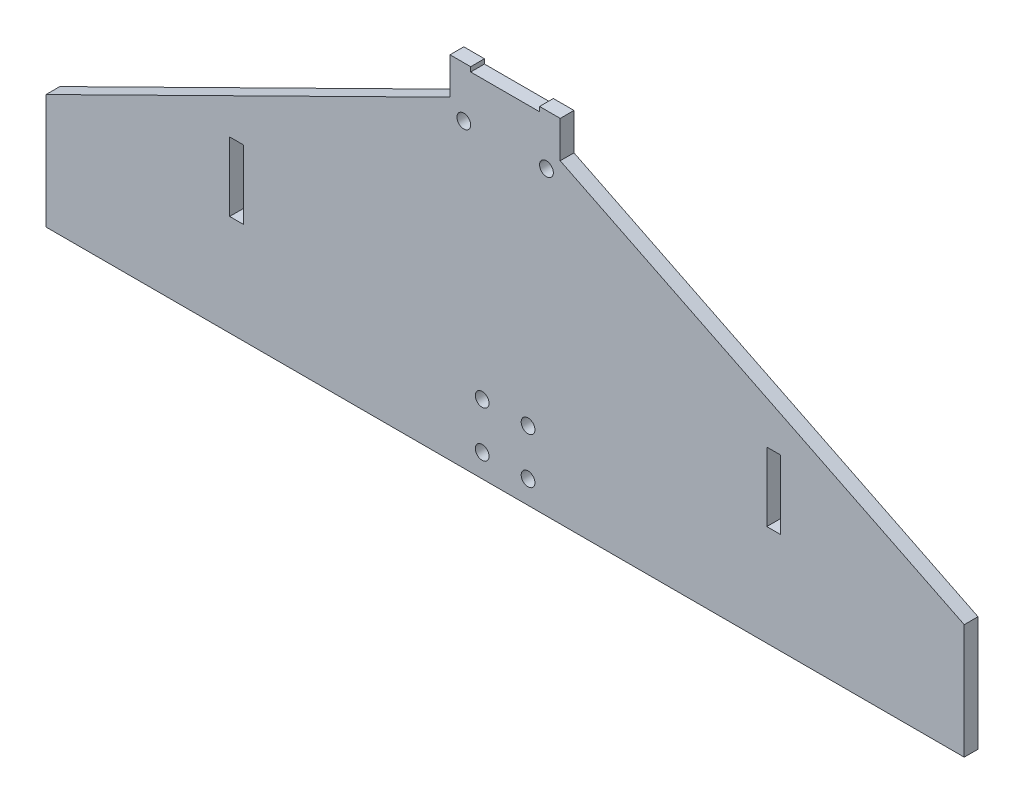
ISO-10303-21;
HEADER;
FILE_DESCRIPTION(('STEP AP214'),'2;1');
FILE_NAME('part.step','',(''),(''),'','','');
FILE_SCHEMA(('AUTOMOTIVE_DESIGN { 1 0 10303 214 1 1 1 1 }'));
ENDSEC;
DATA;
#1=APPLICATION_CONTEXT('core data for automotive mechanical design processes');
#2=APPLICATION_PROTOCOL_DEFINITION('international standard','automotive_design',2000,#1);
#3=PRODUCT_CONTEXT('',#1,'mechanical');
#4=PRODUCT('Part','Part','',(#3));
#5=PRODUCT_RELATED_PRODUCT_CATEGORY('part','',(#4));
#6=PRODUCT_DEFINITION_FORMATION('','',#4);
#7=PRODUCT_DEFINITION_CONTEXT('part definition',#1,'design');
#8=PRODUCT_DEFINITION('design','',#6,#7);
#9=PRODUCT_DEFINITION_SHAPE('','',#8);
#10=(LENGTH_UNIT() NAMED_UNIT(*) SI_UNIT(.MILLI.,.METRE.));
#11=(NAMED_UNIT(*) PLANE_ANGLE_UNIT() SI_UNIT($,.RADIAN.));
#12=(NAMED_UNIT(*) SI_UNIT($,.STERADIAN.) SOLID_ANGLE_UNIT());
#13=UNCERTAINTY_MEASURE_WITH_UNIT(LENGTH_MEASURE(1.E-05),#10,'distance_accuracy_value','');
#14=(GEOMETRIC_REPRESENTATION_CONTEXT(3) GLOBAL_UNCERTAINTY_ASSIGNED_CONTEXT((#13)) GLOBAL_UNIT_ASSIGNED_CONTEXT((#10,
#11,#12)) REPRESENTATION_CONTEXT('',''));
#15=CARTESIAN_POINT('',(0.,0.,0.));
#16=DIRECTION('',(0.,0.,1.));
#17=DIRECTION('',(1.,0.,0.));
#18=AXIS2_PLACEMENT_3D('',#15,#16,#17);
#19=CARTESIAN_POINT('',(-100.,5.00000000000003,3.));
#20=DIRECTION('',(1.,0.,0.));
#21=DIRECTION('',(0.,0.,-1.));
#22=AXIS2_PLACEMENT_3D('',#19,#20,#21);
#23=PLANE('',#22);
#24=DIRECTION('',(0.,-1.,0.));
#25=VECTOR('',#24,1.);
#26=CARTESIAN_POINT('',(-100.,5.00000000000003,0.));
#27=LINE('',#26,#25);
#28=CARTESIAN_POINT('',(-100.,5.00000000000003,0.));
#29=VERTEX_POINT('',#28);
#30=CARTESIAN_POINT('',(-100.,-20.,0.));
#31=VERTEX_POINT('',#30);
#32=EDGE_CURVE('E277',#29,#31,#27,.T.);
#33=ORIENTED_EDGE('',*,*,#32,.T.);
#34=DIRECTION('',(0.,0.,-1.));
#35=VECTOR('',#34,1.);
#36=CARTESIAN_POINT('',(-100.,-20.,3.));
#37=LINE('',#36,#35);
#38=CARTESIAN_POINT('',(-100.,-20.,3.));
#39=VERTEX_POINT('',#38);
#40=EDGE_CURVE('E334',#39,#31,#37,.T.);
#41=ORIENTED_EDGE('',*,*,#40,.F.);
#42=DIRECTION('',(0.,-1.,0.));
#43=VECTOR('',#42,1.);
#44=CARTESIAN_POINT('',(-100.,5.00000000000003,3.));
#45=LINE('',#44,#43);
#46=CARTESIAN_POINT('',(-100.,5.00000000000003,3.));
#47=VERTEX_POINT('',#46);
#48=EDGE_CURVE('E245',#47,#39,#45,.T.);
#49=ORIENTED_EDGE('',*,*,#48,.F.);
#50=DIRECTION('',(0.,0.,-1.));
#51=VECTOR('',#50,1.);
#52=CARTESIAN_POINT('',(-100.,5.00000000000003,3.));
#53=LINE('',#52,#51);
#54=EDGE_CURVE('E276',#47,#29,#53,.T.);
#55=ORIENTED_EDGE('',*,*,#54,.T.);
#56=EDGE_LOOP('',(#33,#41,#49,#55));
#57=FACE_BOUND('',#56,.T.);
#58=ADVANCED_FACE('F37',(#57),#23,.F.);
#59=CARTESIAN_POINT('',(-100.,-20.,3.));
#60=DIRECTION('',(0.,1.,0.));
#61=DIRECTION('',(0.,0.,1.));
#62=AXIS2_PLACEMENT_3D('',#59,#60,#61);
#63=PLANE('',#62);
#64=DIRECTION('',(1.,0.,0.));
#65=VECTOR('',#64,1.);
#66=CARTESIAN_POINT('',(-100.,-20.,0.));
#67=LINE('',#66,#65);
#68=CARTESIAN_POINT('',(100.,-20.,0.));
#69=VERTEX_POINT('',#68);
#70=EDGE_CURVE('E280',#31,#69,#67,.T.);
#71=ORIENTED_EDGE('',*,*,#70,.T.);
#72=DIRECTION('',(0.,0.,-1.));
#73=VECTOR('',#72,1.);
#74=CARTESIAN_POINT('',(100.,-20.,3.));
#75=LINE('',#74,#73);
#76=CARTESIAN_POINT('',(100.,-20.,3.));
#77=VERTEX_POINT('',#76);
#78=EDGE_CURVE('E332',#77,#69,#75,.T.);
#79=ORIENTED_EDGE('',*,*,#78,.F.);
#80=DIRECTION('',(1.,0.,0.));
#81=VECTOR('',#80,1.);
#82=CARTESIAN_POINT('',(-100.,-20.,3.));
#83=LINE('',#82,#81);
#84=EDGE_CURVE('E248',#39,#77,#83,.T.);
#85=ORIENTED_EDGE('',*,*,#84,.F.);
#86=ORIENTED_EDGE('',*,*,#40,.T.);
#87=EDGE_LOOP('',(#71,#79,#85,#86));
#88=FACE_BOUND('',#87,.T.);
#89=ADVANCED_FACE('F387',(#88),#63,.F.);
#90=CARTESIAN_POINT('',(100.,5.00000000000003,3.));
#91=DIRECTION('',(1.,0.,0.));
#92=DIRECTION('',(0.,0.,-1.));
#93=AXIS2_PLACEMENT_3D('',#90,#91,#92);
#94=PLANE('',#93);
#95=DIRECTION('',(0.,-1.,0.));
#96=VECTOR('',#95,1.);
#97=CARTESIAN_POINT('',(100.,5.00000000000003,0.));
#98=LINE('',#97,#96);
#99=CARTESIAN_POINT('',(100.,5.00000000000003,0.));
#100=VERTEX_POINT('',#99);
#101=EDGE_CURVE('E284',#100,#69,#98,.T.);
#102=ORIENTED_EDGE('',*,*,#101,.F.);
#103=DIRECTION('',(0.,0.,-1.));
#104=VECTOR('',#103,1.);
#105=CARTESIAN_POINT('',(100.,5.00000000000003,3.));
#106=LINE('',#105,#104);
#107=CARTESIAN_POINT('',(100.,5.00000000000003,3.));
#108=VERTEX_POINT('',#107);
#109=EDGE_CURVE('E330',#108,#100,#106,.T.);
#110=ORIENTED_EDGE('',*,*,#109,.F.);
#111=DIRECTION('',(0.,-1.,0.));
#112=VECTOR('',#111,1.);
#113=CARTESIAN_POINT('',(100.,5.00000000000003,3.));
#114=LINE('',#113,#112);
#115=EDGE_CURVE('E251',#108,#77,#114,.T.);
#116=ORIENTED_EDGE('',*,*,#115,.T.);
#117=ORIENTED_EDGE('',*,*,#78,.T.);
#118=EDGE_LOOP('',(#102,#110,#116,#117));
#119=FACE_BOUND('',#118,.T.);
#120=ADVANCED_FACE('F392',(#119),#94,.T.);
#121=CARTESIAN_POINT('',(12.,48.5,3.));
#122=DIRECTION('',(0.443134157673179,0.896455307476776,0.));
#123=DIRECTION('',(-0.896455307476777,0.443134157673179,0.));
#124=AXIS2_PLACEMENT_3D('',#121,#122,#123);
#125=PLANE('',#124);
#126=DIRECTION('',(0.896455307476776,-0.443134157673179,0.));
#127=VECTOR('',#126,1.);
#128=CARTESIAN_POINT('',(12.,48.5,0.));
#129=LINE('',#128,#127);
#130=CARTESIAN_POINT('',(12.,48.5,0.));
#131=VERTEX_POINT('',#130);
#132=EDGE_CURVE('E287',#131,#100,#129,.T.);
#133=ORIENTED_EDGE('',*,*,#132,.F.);
#134=DIRECTION('',(0.,0.,-1.));
#135=VECTOR('',#134,1.);
#136=CARTESIAN_POINT('',(12.,48.5,3.));
#137=LINE('',#136,#135);
#138=CARTESIAN_POINT('',(12.,48.5,3.));
#139=VERTEX_POINT('',#138);
#140=EDGE_CURVE('E328',#139,#131,#137,.T.);
#141=ORIENTED_EDGE('',*,*,#140,.F.);
#142=DIRECTION('',(0.896455307476776,-0.443134157673179,0.));
#143=VECTOR('',#142,1.);
#144=CARTESIAN_POINT('',(12.,48.5,3.));
#145=LINE('',#144,#143);
#146=EDGE_CURVE('E254',#139,#108,#145,.T.);
#147=ORIENTED_EDGE('',*,*,#146,.T.);
#148=ORIENTED_EDGE('',*,*,#109,.T.);
#149=EDGE_LOOP('',(#133,#141,#147,#148));
#150=FACE_BOUND('',#149,.T.);
#151=ADVANCED_FACE('F439',(#150),#125,.T.);
#152=CARTESIAN_POINT('',(12.,48.5,3.));
#153=DIRECTION('',(-1.,0.,0.));
#154=DIRECTION('',(0.,0.,1.));
#155=AXIS2_PLACEMENT_3D('',#152,#153,#154);
#156=PLANE('',#155);
#157=DIRECTION('',(0.,1.,0.));
#158=VECTOR('',#157,1.);
#159=CARTESIAN_POINT('',(12.,48.5,0.));
#160=LINE('',#159,#158);
#161=CARTESIAN_POINT('',(12.,56.4999999999999,0.));
#162=VERTEX_POINT('',#161);
#163=EDGE_CURVE('E290',#131,#162,#160,.T.);
#164=ORIENTED_EDGE('',*,*,#163,.T.);
#165=DIRECTION('',(0.,0.,-1.));
#166=VECTOR('',#165,1.);
#167=CARTESIAN_POINT('',(12.,56.4999999999999,3.));
#168=LINE('',#167,#166);
#169=CARTESIAN_POINT('',(12.,56.4999999999999,3.));
#170=VERTEX_POINT('',#169);
#171=EDGE_CURVE('E326',#170,#162,#168,.T.);
#172=ORIENTED_EDGE('',*,*,#171,.F.);
#173=DIRECTION('',(0.,1.,0.));
#174=VECTOR('',#173,1.);
#175=CARTESIAN_POINT('',(12.,48.5,3.));
#176=LINE('',#175,#174);
#177=EDGE_CURVE('E257',#139,#170,#176,.T.);
#178=ORIENTED_EDGE('',*,*,#177,.F.);
#179=ORIENTED_EDGE('',*,*,#140,.T.);
#180=EDGE_LOOP('',(#164,#172,#178,#179));
#181=FACE_BOUND('',#180,.T.);
#182=ADVANCED_FACE('F436',(#181),#156,.F.);
#183=CARTESIAN_POINT('',(7.50000000000051,56.4999999999999,3.));
#184=DIRECTION('',(0.,1.,0.));
#185=DIRECTION('',(-1.,0.,0.));
#186=AXIS2_PLACEMENT_3D('',#183,#184,#185);
#187=PLANE('',#186);
#188=DIRECTION('',(1.,0.,0.));
#189=VECTOR('',#188,1.);
#190=CARTESIAN_POINT('',(7.50000000000051,56.4999999999999,0.));
#191=LINE('',#190,#189);
#192=CARTESIAN_POINT('',(7.50000000000051,56.4999999999999,0.));
#193=VERTEX_POINT('',#192);
#194=EDGE_CURVE('E293',#193,#162,#191,.T.);
#195=ORIENTED_EDGE('',*,*,#194,.F.);
#196=DIRECTION('',(0.,0.,-1.));
#197=VECTOR('',#196,1.);
#198=CARTESIAN_POINT('',(7.50000000000051,56.4999999999999,3.));
#199=LINE('',#198,#197);
#200=CARTESIAN_POINT('',(7.50000000000051,56.4999999999999,3.));
#201=VERTEX_POINT('',#200);
#202=EDGE_CURVE('E324',#201,#193,#199,.T.);
#203=ORIENTED_EDGE('',*,*,#202,.F.);
#204=DIRECTION('',(1.,0.,0.));
#205=VECTOR('',#204,1.);
#206=CARTESIAN_POINT('',(7.50000000000051,56.4999999999999,3.));
#207=LINE('',#206,#205);
#208=EDGE_CURVE('E259',#201,#170,#207,.T.);
#209=ORIENTED_EDGE('',*,*,#208,.T.);
#210=ORIENTED_EDGE('',*,*,#171,.T.);
#211=EDGE_LOOP('',(#195,#203,#209,#210));
#212=FACE_BOUND('',#211,.T.);
#213=ADVANCED_FACE('F430',(#212),#187,.T.);
#214=CARTESIAN_POINT('',(7.50000000000051,56.4999999999999,3.));
#215=DIRECTION('',(1.,0.,0.));
#216=DIRECTION('',(0.,1.,0.));
#217=AXIS2_PLACEMENT_3D('',#214,#215,#216);
#218=PLANE('',#217);
#219=DIRECTION('',(0.,-1.,0.));
#220=VECTOR('',#219,1.);
#221=CARTESIAN_POINT('',(7.50000000000051,56.4999999999999,0.));
#222=LINE('',#221,#220);
#223=CARTESIAN_POINT('',(7.50000000000051,55.5,0.));
#224=VERTEX_POINT('',#223);
#225=EDGE_CURVE('E296',#193,#224,#222,.T.);
#226=ORIENTED_EDGE('',*,*,#225,.T.);
#227=DIRECTION('',(0.,0.,-1.));
#228=VECTOR('',#227,1.);
#229=CARTESIAN_POINT('',(7.50000000000051,55.5,3.));
#230=LINE('',#229,#228);
#231=CARTESIAN_POINT('',(7.50000000000051,55.5,3.));
#232=VERTEX_POINT('',#231);
#233=EDGE_CURVE('E321',#232,#224,#230,.T.);
#234=ORIENTED_EDGE('',*,*,#233,.F.);
#235=DIRECTION('',(0.,-1.,0.));
#236=VECTOR('',#235,1.);
#237=CARTESIAN_POINT('',(7.50000000000051,56.4999999999999,3.));
#238=LINE('',#237,#236);
#239=EDGE_CURVE('E262',#201,#232,#238,.T.);
#240=ORIENTED_EDGE('',*,*,#239,.F.);
#241=ORIENTED_EDGE('',*,*,#202,.T.);
#242=EDGE_LOOP('',(#226,#234,#240,#241));
#243=FACE_BOUND('',#242,.T.);
#244=ADVANCED_FACE('F442',(#243),#218,.F.);
#245=CARTESIAN_POINT('',(7.50000000000051,55.5,3.));
#246=DIRECTION('',(0.,-1.,0.));
#247=DIRECTION('',(1.,0.,0.));
#248=AXIS2_PLACEMENT_3D('',#245,#246,#247);
#249=PLANE('',#248);
#250=DIRECTION('',(-1.,0.,0.));
#251=VECTOR('',#250,1.);
#252=CARTESIAN_POINT('',(7.50000000000051,55.5,0.));
#253=LINE('',#252,#251);
#254=CARTESIAN_POINT('',(-7.50000000000049,55.5,0.));
#255=VERTEX_POINT('',#254);
#256=EDGE_CURVE('E298',#224,#255,#253,.T.);
#257=ORIENTED_EDGE('',*,*,#256,.T.);
#258=DIRECTION('',(0.,0.,-1.));
#259=VECTOR('',#258,1.);
#260=CARTESIAN_POINT('',(-7.50000000000049,55.5,3.));
#261=LINE('',#260,#259);
#262=CARTESIAN_POINT('',(-7.50000000000049,55.5,3.));
#263=VERTEX_POINT('',#262);
#264=EDGE_CURVE('E319',#263,#255,#261,.T.);
#265=ORIENTED_EDGE('',*,*,#264,.F.);
#266=DIRECTION('',(-1.,0.,0.));
#267=VECTOR('',#266,1.);
#268=CARTESIAN_POINT('',(7.50000000000051,55.5,3.));
#269=LINE('',#268,#267);
#270=EDGE_CURVE('E264',#232,#263,#269,.T.);
#271=ORIENTED_EDGE('',*,*,#270,.F.);
#272=ORIENTED_EDGE('',*,*,#233,.T.);
#273=EDGE_LOOP('',(#257,#265,#271,#272));
#274=FACE_BOUND('',#273,.T.);
#275=ADVANCED_FACE('F423',(#274),#249,.F.);
#276=CARTESIAN_POINT('',(-7.50000000000049,56.4999999999999,3.));
#277=DIRECTION('',(1.,0.,0.));
#278=DIRECTION('',(0.,0.,-1.));
#279=AXIS2_PLACEMENT_3D('',#276,#277,#278);
#280=PLANE('',#279);
#281=DIRECTION('',(0.,-1.,0.));
#282=VECTOR('',#281,1.);
#283=CARTESIAN_POINT('',(-7.50000000000049,56.4999999999999,0.));
#284=LINE('',#283,#282);
#285=CARTESIAN_POINT('',(-7.50000000000049,56.4999999999999,0.));
#286=VERTEX_POINT('',#285);
#287=EDGE_CURVE('E301',#286,#255,#284,.T.);
#288=ORIENTED_EDGE('',*,*,#287,.F.);
#289=DIRECTION('',(0.,0.,-1.));
#290=VECTOR('',#289,1.);
#291=CARTESIAN_POINT('',(-7.50000000000049,56.4999999999999,3.));
#292=LINE('',#291,#290);
#293=CARTESIAN_POINT('',(-7.50000000000049,56.4999999999999,3.));
#294=VERTEX_POINT('',#293);
#295=EDGE_CURVE('E317',#294,#286,#292,.T.);
#296=ORIENTED_EDGE('',*,*,#295,.F.);
#297=DIRECTION('',(0.,-1.,0.));
#298=VECTOR('',#297,1.);
#299=CARTESIAN_POINT('',(-7.50000000000049,56.4999999999999,3.));
#300=LINE('',#299,#298);
#301=EDGE_CURVE('E266',#294,#263,#300,.T.);
#302=ORIENTED_EDGE('',*,*,#301,.T.);
#303=ORIENTED_EDGE('',*,*,#264,.T.);
#304=EDGE_LOOP('',(#288,#296,#302,#303));
#305=FACE_BOUND('',#304,.T.);
#306=ADVANCED_FACE('F417',(#305),#280,.T.);
#307=CARTESIAN_POINT('',(-7.50000000000049,56.4999999999999,3.));
#308=DIRECTION('',(0.,-1.,0.));
#309=DIRECTION('',(0.,0.,-1.));
#310=AXIS2_PLACEMENT_3D('',#307,#308,#309);
#311=PLANE('',#310);
#312=DIRECTION('',(-1.,0.,0.));
#313=VECTOR('',#312,1.);
#314=CARTESIAN_POINT('',(-7.50000000000049,56.4999999999999,0.));
#315=LINE('',#314,#313);
#316=CARTESIAN_POINT('',(-12.,56.4999999999999,0.));
#317=VERTEX_POINT('',#316);
#318=EDGE_CURVE('E304',#286,#317,#315,.T.);
#319=ORIENTED_EDGE('',*,*,#318,.T.);
#320=DIRECTION('',(0.,0.,-1.));
#321=VECTOR('',#320,1.);
#322=CARTESIAN_POINT('',(-12.,56.4999999999999,3.));
#323=LINE('',#322,#321);
#324=CARTESIAN_POINT('',(-12.,56.4999999999999,3.));
#325=VERTEX_POINT('',#324);
#326=EDGE_CURVE('E315',#325,#317,#323,.T.);
#327=ORIENTED_EDGE('',*,*,#326,.F.);
#328=DIRECTION('',(-1.,0.,0.));
#329=VECTOR('',#328,1.);
#330=CARTESIAN_POINT('',(-7.50000000000049,56.4999999999999,3.));
#331=LINE('',#330,#329);
#332=EDGE_CURVE('E269',#294,#325,#331,.T.);
#333=ORIENTED_EDGE('',*,*,#332,.F.);
#334=ORIENTED_EDGE('',*,*,#295,.T.);
#335=EDGE_LOOP('',(#319,#327,#333,#334));
#336=FACE_BOUND('',#335,.T.);
#337=ADVANCED_FACE('F493',(#336),#311,.F.);
#338=CARTESIAN_POINT('',(-12.,48.5,3.));
#339=DIRECTION('',(-1.,0.,0.));
#340=DIRECTION('',(0.,0.,1.));
#341=AXIS2_PLACEMENT_3D('',#338,#339,#340);
#342=PLANE('',#341);
#343=DIRECTION('',(0.,1.,0.));
#344=VECTOR('',#343,1.);
#345=CARTESIAN_POINT('',(-12.,48.5,0.));
#346=LINE('',#345,#344);
#347=CARTESIAN_POINT('',(-12.,48.5,0.));
#348=VERTEX_POINT('',#347);
#349=EDGE_CURVE('E307',#348,#317,#346,.T.);
#350=ORIENTED_EDGE('',*,*,#349,.F.);
#351=DIRECTION('',(0.,0.,-1.));
#352=VECTOR('',#351,1.);
#353=CARTESIAN_POINT('',(-12.,48.5,3.));
#354=LINE('',#353,#352);
#355=CARTESIAN_POINT('',(-12.,48.5,3.));
#356=VERTEX_POINT('',#355);
#357=EDGE_CURVE('E313',#356,#348,#354,.T.);
#358=ORIENTED_EDGE('',*,*,#357,.F.);
#359=DIRECTION('',(0.,1.,0.));
#360=VECTOR('',#359,1.);
#361=CARTESIAN_POINT('',(-12.,48.5,3.));
#362=LINE('',#361,#360);
#363=EDGE_CURVE('E271',#356,#325,#362,.T.);
#364=ORIENTED_EDGE('',*,*,#363,.T.);
#365=ORIENTED_EDGE('',*,*,#326,.T.);
#366=EDGE_LOOP('',(#350,#358,#364,#365));
#367=FACE_BOUND('',#366,.T.);
#368=ADVANCED_FACE('F410',(#367),#342,.T.);
#369=CARTESIAN_POINT('',(-12.,48.5,3.));
#370=DIRECTION('',(0.443134157673179,-0.896455307476776,0.));
#371=DIRECTION('',(0.896455307476777,0.443134157673179,0.));
#372=AXIS2_PLACEMENT_3D('',#369,#370,#371);
#373=PLANE('',#372);
#374=DIRECTION('',(-0.896455307476777,-0.443134157673179,0.));
#375=VECTOR('',#374,1.);
#376=CARTESIAN_POINT('',(-12.,48.5,0.));
#377=LINE('',#376,#375);
#378=EDGE_CURVE('E249',#348,#29,#377,.T.);
#379=ORIENTED_EDGE('',*,*,#378,.T.);
#380=ORIENTED_EDGE('',*,*,#54,.F.);
#381=DIRECTION('',(-0.896455307476777,-0.443134157673179,0.));
#382=VECTOR('',#381,1.);
#383=CARTESIAN_POINT('',(-12.,48.5,3.));
#384=LINE('',#383,#382);
#385=EDGE_CURVE('E274',#356,#47,#384,.T.);
#386=ORIENTED_EDGE('',*,*,#385,.F.);
#387=ORIENTED_EDGE('',*,*,#357,.T.);
#388=EDGE_LOOP('',(#379,#380,#386,#387));
#389=FACE_BOUND('',#388,.T.);
#390=ADVANCED_FACE('F408',(#389),#373,.F.);
#391=CARTESIAN_POINT('',(0.,0.,3.));
#392=DIRECTION('',(0.,0.,1.));
#393=DIRECTION('',(1.,0.,0.));
#394=AXIS2_PLACEMENT_3D('',#391,#392,#393);
#395=PLANE('',#394);
#396=DIRECTION('',(0.,-1.,0.));
#397=VECTOR('',#396,1.);
#398=CARTESIAN_POINT('',(-60.,17.,3.));
#399=LINE('',#398,#397);
#400=CARTESIAN_POINT('',(-60.,17.,3.));
#401=VERTEX_POINT('',#400);
#402=CARTESIAN_POINT('',(-60.,2.00000000000003,3.));
#403=VERTEX_POINT('',#402);
#404=EDGE_CURVE('E51',#401,#403,#399,.T.);
#405=ORIENTED_EDGE('',*,*,#404,.F.);
#406=DIRECTION('',(-1.,0.,0.));
#407=VECTOR('',#406,1.);
#408=CARTESIAN_POINT('',(-60.,17.,3.));
#409=LINE('',#408,#407);
#410=CARTESIAN_POINT('',(-57.,17.,3.));
#411=VERTEX_POINT('',#410);
#412=EDGE_CURVE('E197',#411,#401,#409,.T.);
#413=ORIENTED_EDGE('',*,*,#412,.F.);
#414=DIRECTION('',(0.,1.,0.));
#415=VECTOR('',#414,1.);
#416=CARTESIAN_POINT('',(-57.,17.,3.));
#417=LINE('',#416,#415);
#418=CARTESIAN_POINT('',(-57.,2.00000000000003,3.));
#419=VERTEX_POINT('',#418);
#420=EDGE_CURVE('E180',#419,#411,#417,.T.);
#421=ORIENTED_EDGE('',*,*,#420,.F.);
#422=DIRECTION('',(1.,0.,0.));
#423=VECTOR('',#422,1.);
#424=CARTESIAN_POINT('',(-60.,2.00000000000003,3.));
#425=LINE('',#424,#423);
#426=EDGE_CURVE('E190',#403,#419,#425,.T.);
#427=ORIENTED_EDGE('',*,*,#426,.F.);
#428=EDGE_LOOP('',(#405,#413,#421,#427));
#429=FACE_BOUND('',#428,.T.);
#430=DIRECTION('',(-1.,0.,0.));
#431=VECTOR('',#430,1.);
#432=CARTESIAN_POINT('',(60.,17.,3.));
#433=LINE('',#432,#431);
#434=CARTESIAN_POINT('',(60.,17.,3.));
#435=VERTEX_POINT('',#434);
#436=CARTESIAN_POINT('',(57.,17.,3.));
#437=VERTEX_POINT('',#436);
#438=EDGE_CURVE('E59',#435,#437,#433,.T.);
#439=ORIENTED_EDGE('',*,*,#438,.F.);
#440=DIRECTION('',(0.,1.,0.));
#441=VECTOR('',#440,1.);
#442=CARTESIAN_POINT('',(60.,17.,3.));
#443=LINE('',#442,#441);
#444=CARTESIAN_POINT('',(60.,2.00000000000004,3.));
#445=VERTEX_POINT('',#444);
#446=EDGE_CURVE('E214',#445,#435,#443,.T.);
#447=ORIENTED_EDGE('',*,*,#446,.F.);
#448=DIRECTION('',(1.,0.,0.));
#449=VECTOR('',#448,1.);
#450=CARTESIAN_POINT('',(60.,2.00000000000004,3.));
#451=LINE('',#450,#449);
#452=CARTESIAN_POINT('',(57.,2.00000000000004,3.));
#453=VERTEX_POINT('',#452);
#454=EDGE_CURVE('E211',#453,#445,#451,.T.);
#455=ORIENTED_EDGE('',*,*,#454,.F.);
#456=DIRECTION('',(0.,-1.,0.));
#457=VECTOR('',#456,1.);
#458=CARTESIAN_POINT('',(57.,17.,3.));
#459=LINE('',#458,#457);
#460=EDGE_CURVE('E208',#437,#453,#459,.T.);
#461=ORIENTED_EDGE('',*,*,#460,.F.);
#462=EDGE_LOOP('',(#439,#447,#455,#461));
#463=FACE_BOUND('',#462,.T.);
#464=CARTESIAN_POINT('',(-9.,45.5,3.));
#465=DIRECTION('',(0.,0.,1.));
#466=DIRECTION('',(1.,0.,0.));
#467=AXIS2_PLACEMENT_3D('',#464,#465,#466);
#468=CIRCLE('',#467,1.5);
#469=CARTESIAN_POINT('',(-7.5,45.5,3.));
#470=VERTEX_POINT('',#469);
#471=EDGE_CURVE('E225',#470,#470,#468,.T.);
#472=ORIENTED_EDGE('',*,*,#471,.F.);
#473=EDGE_LOOP('',(#472));
#474=FACE_BOUND('',#473,.T.);
#475=CARTESIAN_POINT('',(9.,45.5,3.));
#476=DIRECTION('',(0.,0.,1.));
#477=DIRECTION('',(1.,0.,0.));
#478=AXIS2_PLACEMENT_3D('',#475,#476,#477);
#479=CIRCLE('',#478,1.5);
#480=CARTESIAN_POINT('',(10.5,45.5,3.));
#481=VERTEX_POINT('',#480);
#482=EDGE_CURVE('E204',#481,#481,#479,.T.);
#483=ORIENTED_EDGE('',*,*,#482,.F.);
#484=EDGE_LOOP('',(#483));
#485=FACE_BOUND('',#484,.T.);
#486=CARTESIAN_POINT('',(5.,-4.99999999999997,3.));
#487=DIRECTION('',(0.,0.,1.));
#488=DIRECTION('',(1.,0.,0.));
#489=AXIS2_PLACEMENT_3D('',#486,#487,#488);
#490=CIRCLE('',#489,1.5);
#491=CARTESIAN_POINT('',(6.5,-4.99999999999997,3.));
#492=VERTEX_POINT('',#491);
#493=EDGE_CURVE('E236',#492,#492,#490,.T.);
#494=ORIENTED_EDGE('',*,*,#493,.F.);
#495=EDGE_LOOP('',(#494));
#496=FACE_BOUND('',#495,.T.);
#497=CARTESIAN_POINT('',(-5.00000000000001,-15.,3.));
#498=DIRECTION('',(0.,0.,1.));
#499=DIRECTION('',(1.,0.,0.));
#500=AXIS2_PLACEMENT_3D('',#497,#498,#499);
#501=CIRCLE('',#500,1.5);
#502=CARTESIAN_POINT('',(-3.50000000000001,-15.,3.));
#503=VERTEX_POINT('',#502);
#504=EDGE_CURVE('E234',#503,#503,#501,.T.);
#505=ORIENTED_EDGE('',*,*,#504,.F.);
#506=EDGE_LOOP('',(#505));
#507=FACE_BOUND('',#506,.T.);
#508=CARTESIAN_POINT('',(5.,-15.,3.));
#509=DIRECTION('',(0.,0.,1.));
#510=DIRECTION('',(1.,0.,0.));
#511=AXIS2_PLACEMENT_3D('',#508,#509,#510);
#512=CIRCLE('',#511,1.5);
#513=CARTESIAN_POINT('',(6.5,-15.,3.));
#514=VERTEX_POINT('',#513);
#515=EDGE_CURVE('E231',#514,#514,#512,.T.);
#516=ORIENTED_EDGE('',*,*,#515,.F.);
#517=EDGE_LOOP('',(#516));
#518=FACE_BOUND('',#517,.T.);
#519=CARTESIAN_POINT('',(-5.,-4.99999999999997,3.));
#520=DIRECTION('',(0.,0.,1.));
#521=DIRECTION('',(1.,0.,0.));
#522=AXIS2_PLACEMENT_3D('',#519,#520,#521);
#523=CIRCLE('',#522,1.5);
#524=CARTESIAN_POINT('',(-3.5,-4.99999999999997,3.));
#525=VERTEX_POINT('',#524);
#526=EDGE_CURVE('E239',#525,#525,#523,.T.);
#527=ORIENTED_EDGE('',*,*,#526,.F.);
#528=EDGE_LOOP('',(#527));
#529=FACE_BOUND('',#528,.T.);
#530=ORIENTED_EDGE('',*,*,#48,.T.);
#531=ORIENTED_EDGE('',*,*,#84,.T.);
#532=ORIENTED_EDGE('',*,*,#115,.F.);
#533=ORIENTED_EDGE('',*,*,#146,.F.);
#534=ORIENTED_EDGE('',*,*,#177,.T.);
#535=ORIENTED_EDGE('',*,*,#208,.F.);
#536=ORIENTED_EDGE('',*,*,#239,.T.);
#537=ORIENTED_EDGE('',*,*,#270,.T.);
#538=ORIENTED_EDGE('',*,*,#301,.F.);
#539=ORIENTED_EDGE('',*,*,#332,.T.);
#540=ORIENTED_EDGE('',*,*,#363,.F.);
#541=ORIENTED_EDGE('',*,*,#385,.T.);
#542=EDGE_LOOP('',(#530,#531,#532,#533,#534,#535,#536,#537,#538,#539,#540,#541));
#543=FACE_BOUND('',#542,.T.);
#544=ADVANCED_FACE('F194',(#429,#463,#474,#485,#496,#507,#518,#529,#543),#395,.T.);
#545=CARTESIAN_POINT('',(0.,0.,0.));
#546=DIRECTION('',(0.,0.,1.));
#547=DIRECTION('',(1.,0.,0.));
#548=AXIS2_PLACEMENT_3D('',#545,#546,#547);
#549=PLANE('',#548);
#550=DIRECTION('',(-1.,0.,0.));
#551=VECTOR('',#550,1.);
#552=CARTESIAN_POINT('',(0.,17.,0.));
#553=LINE('',#552,#551);
#554=CARTESIAN_POINT('',(-57.,17.,0.));
#555=VERTEX_POINT('',#554);
#556=CARTESIAN_POINT('',(-60.,17.,0.));
#557=VERTEX_POINT('',#556);
#558=EDGE_CURVE('E44',#555,#557,#553,.T.);
#559=ORIENTED_EDGE('',*,*,#558,.T.);
#560=DIRECTION('',(0.,-1.,0.));
#561=VECTOR('',#560,1.);
#562=CARTESIAN_POINT('',(-60.,0.,0.));
#563=LINE('',#562,#561);
#564=CARTESIAN_POINT('',(-60.,2.00000000000003,0.));
#565=VERTEX_POINT('',#564);
#566=EDGE_CURVE('E11',#557,#565,#563,.T.);
#567=ORIENTED_EDGE('',*,*,#566,.T.);
#568=DIRECTION('',(1.,0.,0.));
#569=VECTOR('',#568,1.);
#570=CARTESIAN_POINT('',(0.,2.00000000000003,0.));
#571=LINE('',#570,#569);
#572=CARTESIAN_POINT('',(-57.,2.00000000000003,0.));
#573=VERTEX_POINT('',#572);
#574=EDGE_CURVE('E363',#565,#573,#571,.T.);
#575=ORIENTED_EDGE('',*,*,#574,.T.);
#576=DIRECTION('',(0.,1.,0.));
#577=VECTOR('',#576,1.);
#578=CARTESIAN_POINT('',(-57.,0.,0.));
#579=LINE('',#578,#577);
#580=EDGE_CURVE('E183',#573,#555,#579,.T.);
#581=ORIENTED_EDGE('',*,*,#580,.T.);
#582=EDGE_LOOP('',(#559,#567,#575,#581));
#583=FACE_BOUND('',#582,.T.);
#584=DIRECTION('',(0.,1.,0.));
#585=VECTOR('',#584,1.);
#586=CARTESIAN_POINT('',(60.,0.,0.));
#587=LINE('',#586,#585);
#588=CARTESIAN_POINT('',(60.,2.00000000000004,0.));
#589=VERTEX_POINT('',#588);
#590=CARTESIAN_POINT('',(60.,17.,0.));
#591=VERTEX_POINT('',#590);
#592=EDGE_CURVE('E357',#589,#591,#587,.T.);
#593=ORIENTED_EDGE('',*,*,#592,.T.);
#594=DIRECTION('',(-1.,0.,0.));
#595=VECTOR('',#594,1.);
#596=CARTESIAN_POINT('',(0.,17.,0.));
#597=LINE('',#596,#595);
#598=CARTESIAN_POINT('',(57.,17.,0.));
#599=VERTEX_POINT('',#598);
#600=EDGE_CURVE('E360',#591,#599,#597,.T.);
#601=ORIENTED_EDGE('',*,*,#600,.T.);
#602=DIRECTION('',(0.,-1.,0.));
#603=VECTOR('',#602,1.);
#604=CARTESIAN_POINT('',(57.,0.,0.));
#605=LINE('',#604,#603);
#606=CARTESIAN_POINT('',(57.,2.00000000000004,0.));
#607=VERTEX_POINT('',#606);
#608=EDGE_CURVE('E337',#599,#607,#605,.T.);
#609=ORIENTED_EDGE('',*,*,#608,.T.);
#610=DIRECTION('',(1.,0.,0.));
#611=VECTOR('',#610,1.);
#612=CARTESIAN_POINT('',(0.,2.00000000000002,0.));
#613=LINE('',#612,#611);
#614=EDGE_CURVE('E354',#607,#589,#613,.T.);
#615=ORIENTED_EDGE('',*,*,#614,.T.);
#616=EDGE_LOOP('',(#593,#601,#609,#615));
#617=FACE_BOUND('',#616,.T.);
#618=CARTESIAN_POINT('',(-9.,45.5,0.));
#619=DIRECTION('',(0.,0.,1.));
#620=DIRECTION('',(1.,0.,0.));
#621=AXIS2_PLACEMENT_3D('',#618,#619,#620);
#622=CIRCLE('',#621,1.5);
#623=CARTESIAN_POINT('',(-7.5,45.5,0.));
#624=VERTEX_POINT('',#623);
#625=EDGE_CURVE('E235',#624,#624,#622,.T.);
#626=ORIENTED_EDGE('',*,*,#625,.T.);
#627=EDGE_LOOP('',(#626));
#628=FACE_BOUND('',#627,.T.);
#629=CARTESIAN_POINT('',(9.,45.5,0.));
#630=DIRECTION('',(0.,0.,1.));
#631=DIRECTION('',(1.,0.,0.));
#632=AXIS2_PLACEMENT_3D('',#629,#630,#631);
#633=CIRCLE('',#632,1.5);
#634=CARTESIAN_POINT('',(10.5,45.5,0.));
#635=VERTEX_POINT('',#634);
#636=EDGE_CURVE('E228',#635,#635,#633,.T.);
#637=ORIENTED_EDGE('',*,*,#636,.T.);
#638=EDGE_LOOP('',(#637));
#639=FACE_BOUND('',#638,.T.);
#640=CARTESIAN_POINT('',(5.,-4.99999999999997,0.));
#641=DIRECTION('',(0.,0.,1.));
#642=DIRECTION('',(1.,0.,0.));
#643=AXIS2_PLACEMENT_3D('',#640,#641,#642);
#644=CIRCLE('',#643,1.5);
#645=CARTESIAN_POINT('',(6.5,-4.99999999999997,0.));
#646=VERTEX_POINT('',#645);
#647=EDGE_CURVE('E281',#646,#646,#644,.T.);
#648=ORIENTED_EDGE('',*,*,#647,.T.);
#649=EDGE_LOOP('',(#648));
#650=FACE_BOUND('',#649,.T.);
#651=CARTESIAN_POINT('',(-5.00000000000001,-15.,0.));
#652=DIRECTION('',(0.,0.,1.));
#653=DIRECTION('',(1.,0.,0.));
#654=AXIS2_PLACEMENT_3D('',#651,#652,#653);
#655=CIRCLE('',#654,1.5);
#656=CARTESIAN_POINT('',(-3.50000000000001,-15.,0.));
#657=VERTEX_POINT('',#656);
#658=EDGE_CURVE('E343',#657,#657,#655,.T.);
#659=ORIENTED_EDGE('',*,*,#658,.T.);
#660=EDGE_LOOP('',(#659));
#661=FACE_BOUND('',#660,.T.);
#662=CARTESIAN_POINT('',(5.,-15.,0.));
#663=DIRECTION('',(0.,0.,1.));
#664=DIRECTION('',(1.,0.,0.));
#665=AXIS2_PLACEMENT_3D('',#662,#663,#664);
#666=CIRCLE('',#665,1.5);
#667=CARTESIAN_POINT('',(6.5,-15.,0.));
#668=VERTEX_POINT('',#667);
#669=EDGE_CURVE('E340',#668,#668,#666,.T.);
#670=ORIENTED_EDGE('',*,*,#669,.T.);
#671=EDGE_LOOP('',(#670));
#672=FACE_BOUND('',#671,.T.);
#673=CARTESIAN_POINT('',(-5.,-4.99999999999997,0.));
#674=DIRECTION('',(0.,0.,1.));
#675=DIRECTION('',(1.,0.,0.));
#676=AXIS2_PLACEMENT_3D('',#673,#674,#675);
#677=CIRCLE('',#676,1.5);
#678=CARTESIAN_POINT('',(-3.5,-4.99999999999997,0.));
#679=VERTEX_POINT('',#678);
#680=EDGE_CURVE('E244',#679,#679,#677,.T.);
#681=ORIENTED_EDGE('',*,*,#680,.T.);
#682=EDGE_LOOP('',(#681));
#683=FACE_BOUND('',#682,.T.);
#684=ORIENTED_EDGE('',*,*,#32,.F.);
#685=ORIENTED_EDGE('',*,*,#378,.F.);
#686=ORIENTED_EDGE('',*,*,#349,.T.);
#687=ORIENTED_EDGE('',*,*,#318,.F.);
#688=ORIENTED_EDGE('',*,*,#287,.T.);
#689=ORIENTED_EDGE('',*,*,#256,.F.);
#690=ORIENTED_EDGE('',*,*,#225,.F.);
#691=ORIENTED_EDGE('',*,*,#194,.T.);
#692=ORIENTED_EDGE('',*,*,#163,.F.);
#693=ORIENTED_EDGE('',*,*,#132,.T.);
#694=ORIENTED_EDGE('',*,*,#101,.T.);
#695=ORIENTED_EDGE('',*,*,#70,.F.);
#696=EDGE_LOOP('',(#684,#685,#686,#687,#688,#689,#690,#691,#692,#693,#694,#695));
#697=FACE_BOUND('',#696,.T.);
#698=ADVANCED_FACE('F367',(#583,#617,#628,#639,#650,#661,#672,#683,#697),#549,.F.);
#699=CARTESIAN_POINT('',(-5.,-4.99999999999997,-2.));
#700=DIRECTION('',(0.,0.,1.));
#701=DIRECTION('',(1.,0.,0.));
#702=AXIS2_PLACEMENT_3D('',#699,#700,#701);
#703=CYLINDRICAL_SURFACE('',#702,1.5);
#704=ORIENTED_EDGE('',*,*,#526,.T.);
#705=EDGE_LOOP('',(#704));
#706=FACE_BOUND('',#705,.T.);
#707=ORIENTED_EDGE('',*,*,#680,.F.);
#708=EDGE_LOOP('',(#707));
#709=FACE_BOUND('',#708,.T.);
#710=ADVANCED_FACE('F523',(#706,#709),#703,.F.);
#711=CARTESIAN_POINT('',(5.,-15.,-2.));
#712=DIRECTION('',(0.,0.,1.));
#713=DIRECTION('',(1.,0.,0.));
#714=AXIS2_PLACEMENT_3D('',#711,#712,#713);
#715=CYLINDRICAL_SURFACE('',#714,1.5);
#716=ORIENTED_EDGE('',*,*,#515,.T.);
#717=EDGE_LOOP('',(#716));
#718=FACE_BOUND('',#717,.T.);
#719=ORIENTED_EDGE('',*,*,#669,.F.);
#720=EDGE_LOOP('',(#719));
#721=FACE_BOUND('',#720,.T.);
#722=ADVANCED_FACE('F528',(#718,#721),#715,.F.);
#723=CARTESIAN_POINT('',(-5.00000000000001,-15.,-2.));
#724=DIRECTION('',(0.,0.,1.));
#725=DIRECTION('',(1.,0.,0.));
#726=AXIS2_PLACEMENT_3D('',#723,#724,#725);
#727=CYLINDRICAL_SURFACE('',#726,1.5);
#728=ORIENTED_EDGE('',*,*,#504,.T.);
#729=EDGE_LOOP('',(#728));
#730=FACE_BOUND('',#729,.T.);
#731=ORIENTED_EDGE('',*,*,#658,.F.);
#732=EDGE_LOOP('',(#731));
#733=FACE_BOUND('',#732,.T.);
#734=ADVANCED_FACE('F540',(#730,#733),#727,.F.);
#735=CARTESIAN_POINT('',(5.,-4.99999999999997,-2.));
#736=DIRECTION('',(0.,0.,1.));
#737=DIRECTION('',(1.,0.,0.));
#738=AXIS2_PLACEMENT_3D('',#735,#736,#737);
#739=CYLINDRICAL_SURFACE('',#738,1.5);
#740=ORIENTED_EDGE('',*,*,#493,.T.);
#741=EDGE_LOOP('',(#740));
#742=FACE_BOUND('',#741,.T.);
#743=ORIENTED_EDGE('',*,*,#647,.F.);
#744=EDGE_LOOP('',(#743));
#745=FACE_BOUND('',#744,.T.);
#746=ADVANCED_FACE('F550',(#742,#745),#739,.F.);
#747=CARTESIAN_POINT('',(9.,45.5,-2.));
#748=DIRECTION('',(0.,0.,1.));
#749=DIRECTION('',(1.,0.,0.));
#750=AXIS2_PLACEMENT_3D('',#747,#748,#749);
#751=CYLINDRICAL_SURFACE('',#750,1.5);
#752=ORIENTED_EDGE('',*,*,#482,.T.);
#753=EDGE_LOOP('',(#752));
#754=FACE_BOUND('',#753,.T.);
#755=ORIENTED_EDGE('',*,*,#636,.F.);
#756=EDGE_LOOP('',(#755));
#757=FACE_BOUND('',#756,.T.);
#758=ADVANCED_FACE('F560',(#754,#757),#751,.F.);
#759=CARTESIAN_POINT('',(-9.,45.5,-2.));
#760=DIRECTION('',(0.,0.,1.));
#761=DIRECTION('',(1.,0.,0.));
#762=AXIS2_PLACEMENT_3D('',#759,#760,#761);
#763=CYLINDRICAL_SURFACE('',#762,1.5);
#764=ORIENTED_EDGE('',*,*,#471,.T.);
#765=EDGE_LOOP('',(#764));
#766=FACE_BOUND('',#765,.T.);
#767=ORIENTED_EDGE('',*,*,#625,.F.);
#768=EDGE_LOOP('',(#767));
#769=FACE_BOUND('',#768,.T.);
#770=ADVANCED_FACE('F570',(#766,#769),#763,.F.);
#771=CARTESIAN_POINT('',(60.,17.,-7.));
#772=DIRECTION('',(0.,1.,0.));
#773=DIRECTION('',(0.,0.,1.));
#774=AXIS2_PLACEMENT_3D('',#771,#772,#773);
#775=PLANE('',#774);
#776=DIRECTION('',(0.,0.,1.));
#777=VECTOR('',#776,1.);
#778=CARTESIAN_POINT('',(60.,17.,-7.));
#779=LINE('',#778,#777);
#780=EDGE_CURVE('E218',#591,#435,#779,.T.);
#781=ORIENTED_EDGE('',*,*,#780,.T.);
#782=ORIENTED_EDGE('',*,*,#438,.T.);
#783=DIRECTION('',(0.,0.,1.));
#784=VECTOR('',#783,1.);
#785=CARTESIAN_POINT('',(57.,17.,-7.));
#786=LINE('',#785,#784);
#787=EDGE_CURVE('E217',#599,#437,#786,.T.);
#788=ORIENTED_EDGE('',*,*,#787,.F.);
#789=ORIENTED_EDGE('',*,*,#600,.F.);
#790=EDGE_LOOP('',(#781,#782,#788,#789));
#791=FACE_BOUND('',#790,.T.);
#792=ADVANCED_FACE('F580',(#791),#775,.F.);
#793=CARTESIAN_POINT('',(60.,17.,-7.));
#794=DIRECTION('',(1.,0.,0.));
#795=DIRECTION('',(0.,0.,-1.));
#796=AXIS2_PLACEMENT_3D('',#793,#794,#795);
#797=PLANE('',#796);
#798=DIRECTION('',(0.,0.,1.));
#799=VECTOR('',#798,1.);
#800=CARTESIAN_POINT('',(60.,2.00000000000004,-7.));
#801=LINE('',#800,#799);
#802=EDGE_CURVE('E220',#589,#445,#801,.T.);
#803=ORIENTED_EDGE('',*,*,#802,.T.);
#804=ORIENTED_EDGE('',*,*,#446,.T.);
#805=ORIENTED_EDGE('',*,*,#780,.F.);
#806=ORIENTED_EDGE('',*,*,#592,.F.);
#807=EDGE_LOOP('',(#803,#804,#805,#806));
#808=FACE_BOUND('',#807,.T.);
#809=ADVANCED_FACE('F602',(#808),#797,.F.);
#810=CARTESIAN_POINT('',(60.,2.00000000000004,-7.));
#811=DIRECTION('',(0.,-1.,0.));
#812=DIRECTION('',(1.,0.,0.));
#813=AXIS2_PLACEMENT_3D('',#810,#811,#812);
#814=PLANE('',#813);
#815=DIRECTION('',(0.,0.,1.));
#816=VECTOR('',#815,1.);
#817=CARTESIAN_POINT('',(57.,2.00000000000004,-7.));
#818=LINE('',#817,#816);
#819=EDGE_CURVE('E222',#607,#453,#818,.T.);
#820=ORIENTED_EDGE('',*,*,#819,.T.);
#821=ORIENTED_EDGE('',*,*,#454,.T.);
#822=ORIENTED_EDGE('',*,*,#802,.F.);
#823=ORIENTED_EDGE('',*,*,#614,.F.);
#824=EDGE_LOOP('',(#820,#821,#822,#823));
#825=FACE_BOUND('',#824,.T.);
#826=ADVANCED_FACE('F381',(#825),#814,.F.);
#827=CARTESIAN_POINT('',(57.,17.,-7.));
#828=DIRECTION('',(-1.,0.,0.));
#829=DIRECTION('',(0.,0.,1.));
#830=AXIS2_PLACEMENT_3D('',#827,#828,#829);
#831=PLANE('',#830);
#832=ORIENTED_EDGE('',*,*,#787,.T.);
#833=ORIENTED_EDGE('',*,*,#460,.T.);
#834=ORIENTED_EDGE('',*,*,#819,.F.);
#835=ORIENTED_EDGE('',*,*,#608,.F.);
#836=EDGE_LOOP('',(#832,#833,#834,#835));
#837=FACE_BOUND('',#836,.T.);
#838=ADVANCED_FACE('F374',(#837),#831,.F.);
#839=CARTESIAN_POINT('',(-60.,17.,-7.));
#840=DIRECTION('',(-1.,0.,0.));
#841=DIRECTION('',(0.,0.,1.));
#842=AXIS2_PLACEMENT_3D('',#839,#840,#841);
#843=PLANE('',#842);
#844=DIRECTION('',(0.,0.,1.));
#845=VECTOR('',#844,1.);
#846=CARTESIAN_POINT('',(-60.,17.,-7.));
#847=LINE('',#846,#845);
#848=EDGE_CURVE('E202',#557,#401,#847,.T.);
#849=ORIENTED_EDGE('',*,*,#848,.T.);
#850=ORIENTED_EDGE('',*,*,#404,.T.);
#851=DIRECTION('',(0.,0.,1.));
#852=VECTOR('',#851,1.);
#853=CARTESIAN_POINT('',(-60.,2.00000000000003,-7.));
#854=LINE('',#853,#852);
#855=EDGE_CURVE('E187',#565,#403,#854,.T.);
#856=ORIENTED_EDGE('',*,*,#855,.F.);
#857=ORIENTED_EDGE('',*,*,#566,.F.);
#858=EDGE_LOOP('',(#849,#850,#856,#857));
#859=FACE_BOUND('',#858,.T.);
#860=ADVANCED_FACE('F372',(#859),#843,.F.);
#861=CARTESIAN_POINT('',(-60.,17.,-7.));
#862=DIRECTION('',(0.,1.,0.));
#863=DIRECTION('',(0.,0.,1.));
#864=AXIS2_PLACEMENT_3D('',#861,#862,#863);
#865=PLANE('',#864);
#866=DIRECTION('',(0.,0.,1.));
#867=VECTOR('',#866,1.);
#868=CARTESIAN_POINT('',(-57.,17.,-7.));
#869=LINE('',#868,#867);
#870=EDGE_CURVE('E186',#555,#411,#869,.T.);
#871=ORIENTED_EDGE('',*,*,#870,.T.);
#872=ORIENTED_EDGE('',*,*,#412,.T.);
#873=ORIENTED_EDGE('',*,*,#848,.F.);
#874=ORIENTED_EDGE('',*,*,#558,.F.);
#875=EDGE_LOOP('',(#871,#872,#873,#874));
#876=FACE_BOUND('',#875,.T.);
#877=ADVANCED_FACE('F371',(#876),#865,.F.);
#878=CARTESIAN_POINT('',(-57.,17.,-7.));
#879=DIRECTION('',(1.,0.,0.));
#880=DIRECTION('',(0.,1.,0.));
#881=AXIS2_PLACEMENT_3D('',#878,#879,#880);
#882=PLANE('',#881);
#883=DIRECTION('',(0.,0.,1.));
#884=VECTOR('',#883,1.);
#885=CARTESIAN_POINT('',(-57.,2.00000000000003,-7.));
#886=LINE('',#885,#884);
#887=EDGE_CURVE('E175',#573,#419,#886,.T.);
#888=ORIENTED_EDGE('',*,*,#887,.T.);
#889=ORIENTED_EDGE('',*,*,#420,.T.);
#890=ORIENTED_EDGE('',*,*,#870,.F.);
#891=ORIENTED_EDGE('',*,*,#580,.F.);
#892=EDGE_LOOP('',(#888,#889,#890,#891));
#893=FACE_BOUND('',#892,.T.);
#894=ADVANCED_FACE('F177',(#893),#882,.F.);
#895=CARTESIAN_POINT('',(-60.,2.00000000000003,-7.));
#896=DIRECTION('',(0.,-1.,0.));
#897=DIRECTION('',(0.,0.,-1.));
#898=AXIS2_PLACEMENT_3D('',#895,#896,#897);
#899=PLANE('',#898);
#900=ORIENTED_EDGE('',*,*,#855,.T.);
#901=ORIENTED_EDGE('',*,*,#426,.T.);
#902=ORIENTED_EDGE('',*,*,#887,.F.);
#903=ORIENTED_EDGE('',*,*,#574,.F.);
#904=EDGE_LOOP('',(#900,#901,#902,#903));
#905=FACE_BOUND('',#904,.T.);
#906=ADVANCED_FACE('F191',(#905),#899,.F.);
#907=CLOSED_SHELL('',(#58,#89,#120,#151,#182,#213,#244,#275,#306,#337,#368,#390,#544,#698,#710,
#722,#734,#746,#758,#770,#792,#809,#826,#838,#860,#877,#894,#906));
#908=MANIFOLD_SOLID_BREP('B2',#907);
#909=ADVANCED_BREP_SHAPE_REPRESENTATION('',(#18,#908),#14);
#910=SHAPE_DEFINITION_REPRESENTATION(#9,#909);
ENDSEC;
END-ISO-10303-21;
